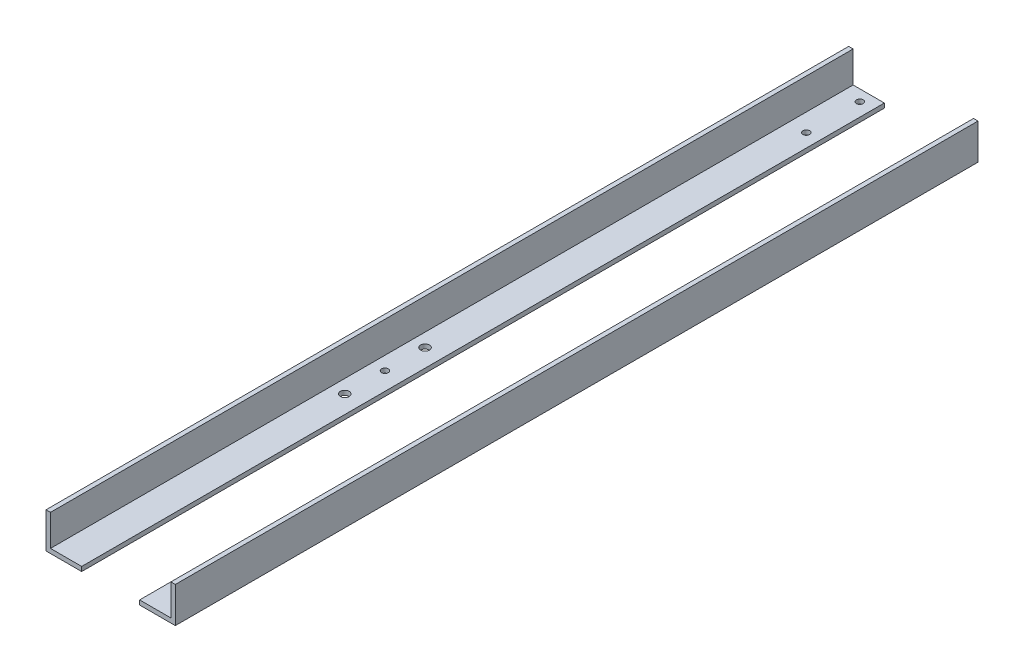
ISO-10303-21;
HEADER;
FILE_DESCRIPTION(('STEP AP214'),'2;1');
FILE_NAME('part.step','',(''),(''),'','','');
FILE_SCHEMA(('AUTOMOTIVE_DESIGN { 1 0 10303 214 1 1 1 1 }'));
ENDSEC;
DATA;
#1=APPLICATION_CONTEXT('core data for automotive mechanical design processes');
#2=APPLICATION_PROTOCOL_DEFINITION('international standard','automotive_design',2000,#1);
#3=PRODUCT_CONTEXT('',#1,'mechanical');
#4=PRODUCT('Part','Part','',(#3));
#5=PRODUCT_RELATED_PRODUCT_CATEGORY('part','',(#4));
#6=PRODUCT_DEFINITION_FORMATION('','',#4);
#7=PRODUCT_DEFINITION_CONTEXT('part definition',#1,'design');
#8=PRODUCT_DEFINITION('design','',#6,#7);
#9=PRODUCT_DEFINITION_SHAPE('','',#8);
#10=(LENGTH_UNIT() NAMED_UNIT(*) SI_UNIT(.MILLI.,.METRE.));
#11=(NAMED_UNIT(*) PLANE_ANGLE_UNIT() SI_UNIT($,.RADIAN.));
#12=(NAMED_UNIT(*) SI_UNIT($,.STERADIAN.) SOLID_ANGLE_UNIT());
#13=UNCERTAINTY_MEASURE_WITH_UNIT(LENGTH_MEASURE(1.E-05),#10,'distance_accuracy_value','');
#14=(GEOMETRIC_REPRESENTATION_CONTEXT(3) GLOBAL_UNCERTAINTY_ASSIGNED_CONTEXT((#13)) GLOBAL_UNIT_ASSIGNED_CONTEXT((#10,
#11,#12)) REPRESENTATION_CONTEXT('',''));
#15=CARTESIAN_POINT('',(0.,0.,0.));
#16=DIRECTION('',(0.,0.,1.));
#17=DIRECTION('',(1.,0.,0.));
#18=AXIS2_PLACEMENT_3D('',#15,#16,#17);
#19=CARTESIAN_POINT('',(-92.075,50.8,-571.5));
#20=DIRECTION('',(0.,0.,1.));
#21=DIRECTION('',(1.,0.,0.));
#22=AXIS2_PLACEMENT_3D('',#19,#20,#21);
#23=PLANE('',#22);
#24=DIRECTION('',(1.,0.,0.));
#25=VECTOR('',#24,1.);
#26=CARTESIAN_POINT('',(41.275,6.35,-571.5));
#27=LINE('',#26,#25);
#28=CARTESIAN_POINT('',(41.275,6.35,-571.5));
#29=VERTEX_POINT('',#28);
#30=CARTESIAN_POINT('',(85.725,6.35,-571.5));
#31=VERTEX_POINT('',#30);
#32=EDGE_CURVE('E139',#29,#31,#27,.T.);
#33=ORIENTED_EDGE('',*,*,#32,.T.);
#34=DIRECTION('',(0.,1.,0.));
#35=VECTOR('',#34,1.);
#36=CARTESIAN_POINT('',(85.725,50.8,-571.5));
#37=LINE('',#36,#35);
#38=CARTESIAN_POINT('',(85.725,50.8,-571.5));
#39=VERTEX_POINT('',#38);
#40=EDGE_CURVE('E135',#31,#39,#37,.T.);
#41=ORIENTED_EDGE('',*,*,#40,.T.);
#42=DIRECTION('',(-1.,0.,0.));
#43=VECTOR('',#42,1.);
#44=CARTESIAN_POINT('',(-92.075,50.8,-571.5));
#45=LINE('',#44,#43);
#46=CARTESIAN_POINT('',(92.075,50.8,-571.5));
#47=VERTEX_POINT('',#46);
#48=EDGE_CURVE('E114',#47,#39,#45,.T.);
#49=ORIENTED_EDGE('',*,*,#48,.F.);
#50=DIRECTION('',(0.,-1.,0.));
#51=VECTOR('',#50,1.);
#52=CARTESIAN_POINT('',(92.075,50.8,-571.5));
#53=LINE('',#52,#51);
#54=CARTESIAN_POINT('',(92.075,0.,-571.5));
#55=VERTEX_POINT('',#54);
#56=EDGE_CURVE('E138',#47,#55,#53,.T.);
#57=ORIENTED_EDGE('',*,*,#56,.T.);
#58=DIRECTION('',(-1.,0.,0.));
#59=VECTOR('',#58,1.);
#60=CARTESIAN_POINT('',(-92.075,0.,-571.5));
#61=LINE('',#60,#59);
#62=CARTESIAN_POINT('',(41.275,0.,-571.5));
#63=VERTEX_POINT('',#62);
#64=EDGE_CURVE('E46',#55,#63,#61,.T.);
#65=ORIENTED_EDGE('',*,*,#64,.T.);
#66=DIRECTION('',(0.,1.,0.));
#67=VECTOR('',#66,1.);
#68=CARTESIAN_POINT('',(41.275,6.35,-571.5));
#69=LINE('',#68,#67);
#70=EDGE_CURVE('E107',#63,#29,#69,.T.);
#71=ORIENTED_EDGE('',*,*,#70,.T.);
#72=EDGE_LOOP('',(#33,#41,#49,#57,#65,#71));
#73=FACE_BOUND('',#72,.T.);
#74=ADVANCED_FACE('F43',(#73),#23,.F.);
#75=CARTESIAN_POINT('',(-92.075,50.8,571.5));
#76=DIRECTION('',(0.,0.,-1.));
#77=DIRECTION('',(-1.,0.,0.));
#78=AXIS2_PLACEMENT_3D('',#75,#76,#77);
#79=PLANE('',#78);
#80=DIRECTION('',(1.,0.,0.));
#81=VECTOR('',#80,1.);
#82=CARTESIAN_POINT('',(-92.075,50.8,571.5));
#83=LINE('',#82,#81);
#84=CARTESIAN_POINT('',(85.725,50.8,571.5));
#85=VERTEX_POINT('',#84);
#86=CARTESIAN_POINT('',(92.075,50.8,571.5));
#87=VERTEX_POINT('',#86);
#88=EDGE_CURVE('E123',#85,#87,#83,.T.);
#89=ORIENTED_EDGE('',*,*,#88,.F.);
#90=DIRECTION('',(0.,1.,0.));
#91=VECTOR('',#90,1.);
#92=CARTESIAN_POINT('',(85.725,50.8,571.5));
#93=LINE('',#92,#91);
#94=CARTESIAN_POINT('',(85.725,6.35,571.5));
#95=VERTEX_POINT('',#94);
#96=EDGE_CURVE('E122',#95,#85,#93,.T.);
#97=ORIENTED_EDGE('',*,*,#96,.F.);
#98=DIRECTION('',(1.,0.,0.));
#99=VECTOR('',#98,1.);
#100=CARTESIAN_POINT('',(41.275,6.35,571.5));
#101=LINE('',#100,#99);
#102=CARTESIAN_POINT('',(41.275,6.35,571.5));
#103=VERTEX_POINT('',#102);
#104=EDGE_CURVE('E127',#103,#95,#101,.T.);
#105=ORIENTED_EDGE('',*,*,#104,.F.);
#106=DIRECTION('',(0.,1.,0.));
#107=VECTOR('',#106,1.);
#108=CARTESIAN_POINT('',(41.275,6.35,571.5));
#109=LINE('',#108,#107);
#110=CARTESIAN_POINT('',(41.275,0.,571.5));
#111=VERTEX_POINT('',#110);
#112=EDGE_CURVE('E52',#111,#103,#109,.T.);
#113=ORIENTED_EDGE('',*,*,#112,.F.);
#114=DIRECTION('',(1.,0.,0.));
#115=VECTOR('',#114,1.);
#116=CARTESIAN_POINT('',(-92.075,0.,571.5));
#117=LINE('',#116,#115);
#118=CARTESIAN_POINT('',(92.075,0.,571.5));
#119=VERTEX_POINT('',#118);
#120=EDGE_CURVE('E97',#111,#119,#117,.T.);
#121=ORIENTED_EDGE('',*,*,#120,.T.);
#122=DIRECTION('',(0.,-1.,0.));
#123=VECTOR('',#122,1.);
#124=CARTESIAN_POINT('',(92.075,50.8,571.5));
#125=LINE('',#124,#123);
#126=EDGE_CURVE('E101',#87,#119,#125,.T.);
#127=ORIENTED_EDGE('',*,*,#126,.F.);
#128=EDGE_LOOP('',(#89,#97,#105,#113,#121,#127));
#129=FACE_BOUND('',#128,.T.);
#130=ADVANCED_FACE('F100',(#129),#79,.F.);
#131=CARTESIAN_POINT('',(0.,0.,0.));
#132=DIRECTION('',(0.,-1.,0.));
#133=DIRECTION('',(0.,0.,-1.));
#134=AXIS2_PLACEMENT_3D('',#131,#132,#133);
#135=PLANE('',#134);
#136=CARTESIAN_POINT('',(60.325,0.,-555.625));
#137=DIRECTION('',(0.,1.,0.));
#138=DIRECTION('',(0.,0.,1.));
#139=AXIS2_PLACEMENT_3D('',#136,#137,#138);
#140=CIRCLE('',#139,4.76250000000001);
#141=CARTESIAN_POINT('',(60.325,0.,-550.8625));
#142=VERTEX_POINT('',#141);
#143=EDGE_CURVE('E142',#142,#142,#140,.T.);
#144=ORIENTED_EDGE('',*,*,#143,.T.);
#145=EDGE_LOOP('',(#144));
#146=FACE_BOUND('',#145,.T.);
#147=CARTESIAN_POINT('',(60.325,0.,-479.425));
#148=DIRECTION('',(0.,1.,0.));
#149=DIRECTION('',(0.,0.,1.));
#150=AXIS2_PLACEMENT_3D('',#147,#148,#149);
#151=CIRCLE('',#150,4.7625);
#152=CARTESIAN_POINT('',(60.325,0.,-474.6625));
#153=VERTEX_POINT('',#152);
#154=EDGE_CURVE('E272',#153,#153,#151,.T.);
#155=ORIENTED_EDGE('',*,*,#154,.T.);
#156=EDGE_LOOP('',(#155));
#157=FACE_BOUND('',#156,.T.);
#158=CARTESIAN_POINT('',(60.325,0.,114.3));
#159=DIRECTION('',(0.,1.,0.));
#160=DIRECTION('',(0.,0.,1.));
#161=AXIS2_PLACEMENT_3D('',#158,#159,#160);
#162=CIRCLE('',#161,4.7625);
#163=CARTESIAN_POINT('',(60.325,0.,119.0625));
#164=VERTEX_POINT('',#163);
#165=EDGE_CURVE('E281',#164,#164,#162,.T.);
#166=ORIENTED_EDGE('',*,*,#165,.T.);
#167=EDGE_LOOP('',(#166));
#168=FACE_BOUND('',#167,.T.);
#169=CARTESIAN_POINT('',(60.325,0.,57.15));
#170=DIRECTION('',(0.,1.,0.));
#171=DIRECTION('',(0.,0.,1.));
#172=AXIS2_PLACEMENT_3D('',#169,#170,#171);
#173=CIRCLE('',#172,6.35);
#174=CARTESIAN_POINT('',(60.325,0.,63.5));
#175=VERTEX_POINT('',#174);
#176=EDGE_CURVE('E287',#175,#175,#173,.T.);
#177=ORIENTED_EDGE('',*,*,#176,.T.);
#178=EDGE_LOOP('',(#177));
#179=FACE_BOUND('',#178,.T.);
#180=CARTESIAN_POINT('',(60.325,0.,171.45));
#181=DIRECTION('',(0.,1.,0.));
#182=DIRECTION('',(0.,0.,1.));
#183=AXIS2_PLACEMENT_3D('',#180,#181,#182);
#184=CIRCLE('',#183,6.34999999999999);
#185=CARTESIAN_POINT('',(60.325,0.,177.8));
#186=VERTEX_POINT('',#185);
#187=EDGE_CURVE('E293',#186,#186,#184,.T.);
#188=ORIENTED_EDGE('',*,*,#187,.T.);
#189=EDGE_LOOP('',(#188));
#190=FACE_BOUND('',#189,.T.);
#191=DIRECTION('',(0.,0.,1.));
#192=VECTOR('',#191,1.);
#193=CARTESIAN_POINT('',(41.275,0.,-571.5));
#194=LINE('',#193,#192);
#195=EDGE_CURVE('E12',#63,#111,#194,.T.);
#196=ORIENTED_EDGE('',*,*,#195,.F.);
#197=ORIENTED_EDGE('',*,*,#64,.F.);
#198=DIRECTION('',(0.,0.,-1.));
#199=VECTOR('',#198,1.);
#200=CARTESIAN_POINT('',(92.075,0.,571.5));
#201=LINE('',#200,#199);
#202=EDGE_CURVE('E106',#119,#55,#201,.T.);
#203=ORIENTED_EDGE('',*,*,#202,.F.);
#204=ORIENTED_EDGE('',*,*,#120,.F.);
#205=EDGE_LOOP('',(#196,#197,#203,#204));
#206=FACE_BOUND('',#205,.T.);
#207=ADVANCED_FACE('F116',(#146,#157,#168,#179,#190,#206),#135,.T.);
#208=CARTESIAN_POINT('',(92.075,50.8,571.5));
#209=DIRECTION('',(-1.,0.,0.));
#210=DIRECTION('',(0.,0.,1.));
#211=AXIS2_PLACEMENT_3D('',#208,#209,#210);
#212=PLANE('',#211);
#213=ORIENTED_EDGE('',*,*,#202,.T.);
#214=ORIENTED_EDGE('',*,*,#56,.F.);
#215=DIRECTION('',(0.,0.,-1.));
#216=VECTOR('',#215,1.);
#217=CARTESIAN_POINT('',(92.075,50.8,571.5));
#218=LINE('',#217,#216);
#219=EDGE_CURVE('E113',#87,#47,#218,.T.);
#220=ORIENTED_EDGE('',*,*,#219,.F.);
#221=ORIENTED_EDGE('',*,*,#126,.T.);
#222=EDGE_LOOP('',(#213,#214,#220,#221));
#223=FACE_BOUND('',#222,.T.);
#224=ADVANCED_FACE('F110',(#223),#212,.F.);
#225=CARTESIAN_POINT('',(0.,50.8,0.));
#226=DIRECTION('',(0.,-1.,0.));
#227=DIRECTION('',(0.,0.,-1.));
#228=AXIS2_PLACEMENT_3D('',#225,#226,#227);
#229=PLANE('',#228);
#230=ORIENTED_EDGE('',*,*,#48,.T.);
#231=DIRECTION('',(0.,0.,1.));
#232=VECTOR('',#231,1.);
#233=CARTESIAN_POINT('',(85.725,50.8,-571.5));
#234=LINE('',#233,#232);
#235=EDGE_CURVE('E129',#39,#85,#234,.T.);
#236=ORIENTED_EDGE('',*,*,#235,.T.);
#237=ORIENTED_EDGE('',*,*,#88,.T.);
#238=ORIENTED_EDGE('',*,*,#219,.T.);
#239=EDGE_LOOP('',(#230,#236,#237,#238));
#240=FACE_BOUND('',#239,.T.);
#241=ADVANCED_FACE('F148',(#240),#229,.F.);
#242=CARTESIAN_POINT('',(85.725,50.8,-571.5));
#243=DIRECTION('',(1.,0.,0.));
#244=DIRECTION('',(0.,1.,0.));
#245=AXIS2_PLACEMENT_3D('',#242,#243,#244);
#246=PLANE('',#245);
#247=ORIENTED_EDGE('',*,*,#96,.T.);
#248=ORIENTED_EDGE('',*,*,#235,.F.);
#249=ORIENTED_EDGE('',*,*,#40,.F.);
#250=DIRECTION('',(0.,0.,1.));
#251=VECTOR('',#250,1.);
#252=CARTESIAN_POINT('',(85.725,6.35,-571.5));
#253=LINE('',#252,#251);
#254=EDGE_CURVE('E76',#31,#95,#253,.T.);
#255=ORIENTED_EDGE('',*,*,#254,.T.);
#256=EDGE_LOOP('',(#247,#248,#249,#255));
#257=FACE_BOUND('',#256,.T.);
#258=ADVANCED_FACE('F150',(#257),#246,.F.);
#259=CARTESIAN_POINT('',(41.275,6.35,-571.5));
#260=DIRECTION('',(0.,-1.,0.));
#261=DIRECTION('',(0.,0.,-1.));
#262=AXIS2_PLACEMENT_3D('',#259,#260,#261);
#263=PLANE('',#262);
#264=CARTESIAN_POINT('',(60.325,6.35,-555.625));
#265=DIRECTION('',(0.,1.,0.));
#266=DIRECTION('',(0.,0.,1.));
#267=AXIS2_PLACEMENT_3D('',#264,#265,#266);
#268=CIRCLE('',#267,4.76250000000001);
#269=CARTESIAN_POINT('',(60.325,6.35,-550.8625));
#270=VERTEX_POINT('',#269);
#271=EDGE_CURVE('E271',#270,#270,#268,.T.);
#272=ORIENTED_EDGE('',*,*,#271,.F.);
#273=EDGE_LOOP('',(#272));
#274=FACE_BOUND('',#273,.T.);
#275=CARTESIAN_POINT('',(60.325,6.35,-479.425));
#276=DIRECTION('',(0.,1.,0.));
#277=DIRECTION('',(0.,0.,1.));
#278=AXIS2_PLACEMENT_3D('',#275,#276,#277);
#279=CIRCLE('',#278,4.7625);
#280=CARTESIAN_POINT('',(60.325,6.35,-474.6625));
#281=VERTEX_POINT('',#280);
#282=EDGE_CURVE('E276',#281,#281,#279,.T.);
#283=ORIENTED_EDGE('',*,*,#282,.F.);
#284=EDGE_LOOP('',(#283));
#285=FACE_BOUND('',#284,.T.);
#286=CARTESIAN_POINT('',(60.325,6.35,114.3));
#287=DIRECTION('',(0.,1.,0.));
#288=DIRECTION('',(0.,0.,1.));
#289=AXIS2_PLACEMENT_3D('',#286,#287,#288);
#290=CIRCLE('',#289,4.7625);
#291=CARTESIAN_POINT('',(60.325,6.35,119.0625));
#292=VERTEX_POINT('',#291);
#293=EDGE_CURVE('E284',#292,#292,#290,.T.);
#294=ORIENTED_EDGE('',*,*,#293,.F.);
#295=EDGE_LOOP('',(#294));
#296=FACE_BOUND('',#295,.T.);
#297=CARTESIAN_POINT('',(60.325,6.35,57.15));
#298=DIRECTION('',(0.,1.,0.));
#299=DIRECTION('',(0.,0.,1.));
#300=AXIS2_PLACEMENT_3D('',#297,#298,#299);
#301=CIRCLE('',#300,6.35);
#302=CARTESIAN_POINT('',(60.325,6.35,63.5));
#303=VERTEX_POINT('',#302);
#304=EDGE_CURVE('E290',#303,#303,#301,.T.);
#305=ORIENTED_EDGE('',*,*,#304,.F.);
#306=EDGE_LOOP('',(#305));
#307=FACE_BOUND('',#306,.T.);
#308=CARTESIAN_POINT('',(60.325,6.35,171.45));
#309=DIRECTION('',(0.,1.,0.));
#310=DIRECTION('',(0.,0.,1.));
#311=AXIS2_PLACEMENT_3D('',#308,#309,#310);
#312=CIRCLE('',#311,6.34999999999999);
#313=CARTESIAN_POINT('',(60.325,6.35,177.8));
#314=VERTEX_POINT('',#313);
#315=EDGE_CURVE('E296',#314,#314,#312,.T.);
#316=ORIENTED_EDGE('',*,*,#315,.F.);
#317=EDGE_LOOP('',(#316));
#318=FACE_BOUND('',#317,.T.);
#319=ORIENTED_EDGE('',*,*,#104,.T.);
#320=ORIENTED_EDGE('',*,*,#254,.F.);
#321=ORIENTED_EDGE('',*,*,#32,.F.);
#322=DIRECTION('',(0.,0.,1.));
#323=VECTOR('',#322,1.);
#324=CARTESIAN_POINT('',(41.275,6.35,-571.5));
#325=LINE('',#324,#323);
#326=EDGE_CURVE('E125',#29,#103,#325,.T.);
#327=ORIENTED_EDGE('',*,*,#326,.T.);
#328=EDGE_LOOP('',(#319,#320,#321,#327));
#329=FACE_BOUND('',#328,.T.);
#330=ADVANCED_FACE('F152',(#274,#285,#296,#307,#318,#329),#263,.F.);
#331=CARTESIAN_POINT('',(41.275,6.35,-571.5));
#332=DIRECTION('',(1.,0.,0.));
#333=DIRECTION('',(0.,0.,-1.));
#334=AXIS2_PLACEMENT_3D('',#331,#332,#333);
#335=PLANE('',#334);
#336=ORIENTED_EDGE('',*,*,#112,.T.);
#337=ORIENTED_EDGE('',*,*,#326,.F.);
#338=ORIENTED_EDGE('',*,*,#70,.F.);
#339=ORIENTED_EDGE('',*,*,#195,.T.);
#340=EDGE_LOOP('',(#336,#337,#338,#339));
#341=FACE_BOUND('',#340,.T.);
#342=ADVANCED_FACE('F154',(#341),#335,.F.);
#343=CARTESIAN_POINT('',(60.325,0.,171.45));
#344=DIRECTION('',(0.,1.,0.));
#345=DIRECTION('',(0.,0.,1.));
#346=AXIS2_PLACEMENT_3D('',#343,#344,#345);
#347=CYLINDRICAL_SURFACE('',#346,6.34999999999999);
#348=ORIENTED_EDGE('',*,*,#187,.F.);
#349=EDGE_LOOP('',(#348));
#350=FACE_BOUND('',#349,.T.);
#351=ORIENTED_EDGE('',*,*,#315,.T.);
#352=EDGE_LOOP('',(#351));
#353=FACE_BOUND('',#352,.T.);
#354=ADVANCED_FACE('F156',(#350,#353),#347,.F.);
#355=CARTESIAN_POINT('',(60.325,0.,57.15));
#356=DIRECTION('',(0.,1.,0.));
#357=DIRECTION('',(0.,0.,1.));
#358=AXIS2_PLACEMENT_3D('',#355,#356,#357);
#359=CYLINDRICAL_SURFACE('',#358,6.35);
#360=ORIENTED_EDGE('',*,*,#176,.F.);
#361=EDGE_LOOP('',(#360));
#362=FACE_BOUND('',#361,.T.);
#363=ORIENTED_EDGE('',*,*,#304,.T.);
#364=EDGE_LOOP('',(#363));
#365=FACE_BOUND('',#364,.T.);
#366=ADVANCED_FACE('F162',(#362,#365),#359,.F.);
#367=CARTESIAN_POINT('',(60.325,0.,114.3));
#368=DIRECTION('',(0.,1.,0.));
#369=DIRECTION('',(0.,0.,1.));
#370=AXIS2_PLACEMENT_3D('',#367,#368,#369);
#371=CYLINDRICAL_SURFACE('',#370,4.7625);
#372=ORIENTED_EDGE('',*,*,#165,.F.);
#373=EDGE_LOOP('',(#372));
#374=FACE_BOUND('',#373,.T.);
#375=ORIENTED_EDGE('',*,*,#293,.T.);
#376=EDGE_LOOP('',(#375));
#377=FACE_BOUND('',#376,.T.);
#378=ADVANCED_FACE('F209',(#374,#377),#371,.F.);
#379=CARTESIAN_POINT('',(60.325,0.,-479.425));
#380=DIRECTION('',(0.,1.,0.));
#381=DIRECTION('',(0.,0.,1.));
#382=AXIS2_PLACEMENT_3D('',#379,#380,#381);
#383=CYLINDRICAL_SURFACE('',#382,4.7625);
#384=ORIENTED_EDGE('',*,*,#154,.F.);
#385=EDGE_LOOP('',(#384));
#386=FACE_BOUND('',#385,.T.);
#387=ORIENTED_EDGE('',*,*,#282,.T.);
#388=EDGE_LOOP('',(#387));
#389=FACE_BOUND('',#388,.T.);
#390=ADVANCED_FACE('F219',(#386,#389),#383,.F.);
#391=CARTESIAN_POINT('',(60.325,0.,-555.625));
#392=DIRECTION('',(0.,1.,0.));
#393=DIRECTION('',(0.,0.,1.));
#394=AXIS2_PLACEMENT_3D('',#391,#392,#393);
#395=CYLINDRICAL_SURFACE('',#394,4.76250000000001);
#396=ORIENTED_EDGE('',*,*,#143,.F.);
#397=EDGE_LOOP('',(#396));
#398=FACE_BOUND('',#397,.T.);
#399=ORIENTED_EDGE('',*,*,#271,.T.);
#400=EDGE_LOOP('',(#399));
#401=FACE_BOUND('',#400,.T.);
#402=ADVANCED_FACE('F229',(#398,#401),#395,.F.);
#403=CLOSED_SHELL('',(#74,#130,#207,#224,#241,#258,#330,#342,#354,#366,#378,#390,#402));
#404=MANIFOLD_SOLID_BREP('B2',#403);
#405=CARTESIAN_POINT('',(-92.075,50.8,571.5));
#406=DIRECTION('',(1.,0.,0.));
#407=DIRECTION('',(0.,0.,-1.));
#408=AXIS2_PLACEMENT_3D('',#405,#406,#407);
#409=PLANE('',#408);
#410=DIRECTION('',(0.,0.,1.));
#411=VECTOR('',#410,1.);
#412=CARTESIAN_POINT('',(-92.075,0.,571.5));
#413=LINE('',#412,#411);
#414=CARTESIAN_POINT('',(-92.075,0.,-571.5));
#415=VERTEX_POINT('',#414);
#416=CARTESIAN_POINT('',(-92.075,0.,571.5));
#417=VERTEX_POINT('',#416);
#418=EDGE_CURVE('E360',#415,#417,#413,.T.);
#419=ORIENTED_EDGE('',*,*,#418,.T.);
#420=DIRECTION('',(0.,-1.,0.));
#421=VECTOR('',#420,1.);
#422=CARTESIAN_POINT('',(-92.075,50.8,571.5));
#423=LINE('',#422,#421);
#424=CARTESIAN_POINT('',(-92.075,50.8,571.5));
#425=VERTEX_POINT('',#424);
#426=EDGE_CURVE('E332',#425,#417,#423,.T.);
#427=ORIENTED_EDGE('',*,*,#426,.F.);
#428=DIRECTION('',(0.,0.,1.));
#429=VECTOR('',#428,1.);
#430=CARTESIAN_POINT('',(-92.075,50.8,571.5));
#431=LINE('',#430,#429);
#432=CARTESIAN_POINT('',(-92.075,50.8,-571.5));
#433=VERTEX_POINT('',#432);
#434=EDGE_CURVE('E348',#433,#425,#431,.T.);
#435=ORIENTED_EDGE('',*,*,#434,.F.);
#436=DIRECTION('',(0.,-1.,0.));
#437=VECTOR('',#436,1.);
#438=CARTESIAN_POINT('',(-92.075,50.8,-571.5));
#439=LINE('',#438,#437);
#440=EDGE_CURVE('E41',#433,#415,#439,.T.);
#441=ORIENTED_EDGE('',*,*,#440,.T.);
#442=EDGE_LOOP('',(#419,#427,#435,#441));
#443=FACE_BOUND('',#442,.T.);
#444=ADVANCED_FACE('F324',(#443),#409,.F.);
#445=CARTESIAN_POINT('',(0.,0.,0.));
#446=DIRECTION('',(0.,-1.,0.));
#447=DIRECTION('',(0.,0.,-1.));
#448=AXIS2_PLACEMENT_3D('',#445,#446,#447);
#449=PLANE('',#448);
#450=CARTESIAN_POINT('',(-60.325,0.,-555.625));
#451=DIRECTION('',(0.,1.,0.));
#452=DIRECTION('',(0.,0.,1.));
#453=AXIS2_PLACEMENT_3D('',#450,#451,#452);
#454=CIRCLE('',#453,4.76250000000002);
#455=CARTESIAN_POINT('',(-60.325,0.,-550.8625));
#456=VERTEX_POINT('',#455);
#457=EDGE_CURVE('E403',#456,#456,#454,.T.);
#458=ORIENTED_EDGE('',*,*,#457,.T.);
#459=EDGE_LOOP('',(#458));
#460=FACE_BOUND('',#459,.T.);
#461=CARTESIAN_POINT('',(-60.325,0.,-479.425));
#462=DIRECTION('',(0.,1.,0.));
#463=DIRECTION('',(0.,0.,1.));
#464=AXIS2_PLACEMENT_3D('',#461,#462,#463);
#465=CIRCLE('',#464,4.7625);
#466=CARTESIAN_POINT('',(-60.325,0.,-474.6625));
#467=VERTEX_POINT('',#466);
#468=EDGE_CURVE('E432',#467,#467,#465,.T.);
#469=ORIENTED_EDGE('',*,*,#468,.T.);
#470=EDGE_LOOP('',(#469));
#471=FACE_BOUND('',#470,.T.);
#472=CARTESIAN_POINT('',(-66.675,0.,114.3));
#473=DIRECTION('',(0.,1.,0.));
#474=DIRECTION('',(0.,0.,1.));
#475=AXIS2_PLACEMENT_3D('',#472,#473,#474);
#476=CIRCLE('',#475,4.7625);
#477=CARTESIAN_POINT('',(-66.675,0.,119.0625));
#478=VERTEX_POINT('',#477);
#479=EDGE_CURVE('E426',#478,#478,#476,.T.);
#480=ORIENTED_EDGE('',*,*,#479,.T.);
#481=EDGE_LOOP('',(#480));
#482=FACE_BOUND('',#481,.T.);
#483=CARTESIAN_POINT('',(-66.675,0.,57.15));
#484=DIRECTION('',(0.,1.,0.));
#485=DIRECTION('',(0.,0.,1.));
#486=AXIS2_PLACEMENT_3D('',#483,#484,#485);
#487=CIRCLE('',#486,6.35);
#488=CARTESIAN_POINT('',(-66.675,0.,63.5));
#489=VERTEX_POINT('',#488);
#490=EDGE_CURVE('E420',#489,#489,#487,.T.);
#491=ORIENTED_EDGE('',*,*,#490,.T.);
#492=EDGE_LOOP('',(#491));
#493=FACE_BOUND('',#492,.T.);
#494=CARTESIAN_POINT('',(-66.675,0.,171.45));
#495=DIRECTION('',(0.,1.,0.));
#496=DIRECTION('',(0.,0.,1.));
#497=AXIS2_PLACEMENT_3D('',#494,#495,#496);
#498=CIRCLE('',#497,6.35);
#499=CARTESIAN_POINT('',(-66.675,0.,177.8));
#500=VERTEX_POINT('',#499);
#501=EDGE_CURVE('E414',#500,#500,#498,.T.);
#502=ORIENTED_EDGE('',*,*,#501,.T.);
#503=EDGE_LOOP('',(#502));
#504=FACE_BOUND('',#503,.T.);
#505=DIRECTION('',(0.,0.,1.));
#506=VECTOR('',#505,1.);
#507=CARTESIAN_POINT('',(-41.275,0.,-571.5));
#508=LINE('',#507,#506);
#509=CARTESIAN_POINT('',(-41.275,0.,-571.5));
#510=VERTEX_POINT('',#509);
#511=CARTESIAN_POINT('',(-41.275,0.,571.5));
#512=VERTEX_POINT('',#511);
#513=EDGE_CURVE('E377',#510,#512,#508,.T.);
#514=ORIENTED_EDGE('',*,*,#513,.T.);
#515=DIRECTION('',(1.,0.,0.));
#516=VECTOR('',#515,1.);
#517=CARTESIAN_POINT('',(-92.075,0.,571.5));
#518=LINE('',#517,#516);
#519=EDGE_CURVE('E367',#417,#512,#518,.T.);
#520=ORIENTED_EDGE('',*,*,#519,.F.);
#521=ORIENTED_EDGE('',*,*,#418,.F.);
#522=DIRECTION('',(-1.,0.,0.));
#523=VECTOR('',#522,1.);
#524=CARTESIAN_POINT('',(-92.075,0.,-571.5));
#525=LINE('',#524,#523);
#526=EDGE_CURVE('E368',#510,#415,#525,.T.);
#527=ORIENTED_EDGE('',*,*,#526,.F.);
#528=EDGE_LOOP('',(#514,#520,#521,#527));
#529=FACE_BOUND('',#528,.T.);
#530=ADVANCED_FACE('F376',(#460,#471,#482,#493,#504,#529),#449,.T.);
#531=CARTESIAN_POINT('',(0.,50.8,0.));
#532=DIRECTION('',(0.,-1.,0.));
#533=DIRECTION('',(0.,0.,-1.));
#534=AXIS2_PLACEMENT_3D('',#531,#532,#533);
#535=PLANE('',#534);
#536=DIRECTION('',(1.,0.,0.));
#537=VECTOR('',#536,1.);
#538=CARTESIAN_POINT('',(-92.075,50.8,571.5));
#539=LINE('',#538,#537);
#540=CARTESIAN_POINT('',(-85.725,50.8,571.5));
#541=VERTEX_POINT('',#540);
#542=EDGE_CURVE('E375',#425,#541,#539,.T.);
#543=ORIENTED_EDGE('',*,*,#542,.T.);
#544=DIRECTION('',(0.,0.,1.));
#545=VECTOR('',#544,1.);
#546=CARTESIAN_POINT('',(-85.725,50.8,-571.5));
#547=LINE('',#546,#545);
#548=CARTESIAN_POINT('',(-85.725,50.8,-571.5));
#549=VERTEX_POINT('',#548);
#550=EDGE_CURVE('E383',#549,#541,#547,.T.);
#551=ORIENTED_EDGE('',*,*,#550,.F.);
#552=DIRECTION('',(-1.,0.,0.));
#553=VECTOR('',#552,1.);
#554=CARTESIAN_POINT('',(-92.075,50.8,-571.5));
#555=LINE('',#554,#553);
#556=EDGE_CURVE('E378',#549,#433,#555,.T.);
#557=ORIENTED_EDGE('',*,*,#556,.T.);
#558=ORIENTED_EDGE('',*,*,#434,.T.);
#559=EDGE_LOOP('',(#543,#551,#557,#558));
#560=FACE_BOUND('',#559,.T.);
#561=ADVANCED_FACE('F485',(#560),#535,.F.);
#562=CARTESIAN_POINT('',(-92.075,50.8,571.5));
#563=DIRECTION('',(0.,0.,-1.));
#564=DIRECTION('',(-1.,0.,0.));
#565=AXIS2_PLACEMENT_3D('',#562,#563,#564);
#566=PLANE('',#565);
#567=DIRECTION('',(1.,0.,0.));
#568=VECTOR('',#567,1.);
#569=CARTESIAN_POINT('',(-85.725,6.35,571.5));
#570=LINE('',#569,#568);
#571=CARTESIAN_POINT('',(-85.725,6.35,571.5));
#572=VERTEX_POINT('',#571);
#573=CARTESIAN_POINT('',(-41.275,6.35,571.5));
#574=VERTEX_POINT('',#573);
#575=EDGE_CURVE('E397',#572,#574,#570,.T.);
#576=ORIENTED_EDGE('',*,*,#575,.F.);
#577=DIRECTION('',(0.,-1.,0.));
#578=VECTOR('',#577,1.);
#579=CARTESIAN_POINT('',(-85.725,50.8,571.5));
#580=LINE('',#579,#578);
#581=EDGE_CURVE('E400',#541,#572,#580,.T.);
#582=ORIENTED_EDGE('',*,*,#581,.F.);
#583=ORIENTED_EDGE('',*,*,#542,.F.);
#584=ORIENTED_EDGE('',*,*,#426,.T.);
#585=ORIENTED_EDGE('',*,*,#519,.T.);
#586=DIRECTION('',(0.,-1.,0.));
#587=VECTOR('',#586,1.);
#588=CARTESIAN_POINT('',(-41.275,6.35,571.5));
#589=LINE('',#588,#587);
#590=EDGE_CURVE('E339',#574,#512,#589,.T.);
#591=ORIENTED_EDGE('',*,*,#590,.F.);
#592=EDGE_LOOP('',(#576,#582,#583,#584,#585,#591));
#593=FACE_BOUND('',#592,.T.);
#594=ADVANCED_FACE('F373',(#593),#566,.F.);
#595=CARTESIAN_POINT('',(-92.075,50.8,-571.5));
#596=DIRECTION('',(0.,0.,1.));
#597=DIRECTION('',(1.,0.,0.));
#598=AXIS2_PLACEMENT_3D('',#595,#596,#597);
#599=PLANE('',#598);
#600=ORIENTED_EDGE('',*,*,#556,.F.);
#601=DIRECTION('',(0.,-1.,0.));
#602=VECTOR('',#601,1.);
#603=CARTESIAN_POINT('',(-85.725,50.8,-571.5));
#604=LINE('',#603,#602);
#605=CARTESIAN_POINT('',(-85.725,6.35,-571.5));
#606=VERTEX_POINT('',#605);
#607=EDGE_CURVE('E396',#549,#606,#604,.T.);
#608=ORIENTED_EDGE('',*,*,#607,.T.);
#609=DIRECTION('',(1.,0.,0.));
#610=VECTOR('',#609,1.);
#611=CARTESIAN_POINT('',(-85.725,6.35,-571.5));
#612=LINE('',#611,#610);
#613=CARTESIAN_POINT('',(-41.275,6.35,-571.5));
#614=VERTEX_POINT('',#613);
#615=EDGE_CURVE('E406',#606,#614,#612,.T.);
#616=ORIENTED_EDGE('',*,*,#615,.T.);
#617=DIRECTION('',(0.,-1.,0.));
#618=VECTOR('',#617,1.);
#619=CARTESIAN_POINT('',(-41.275,6.35,-571.5));
#620=LINE('',#619,#618);
#621=EDGE_CURVE('E390',#614,#510,#620,.T.);
#622=ORIENTED_EDGE('',*,*,#621,.T.);
#623=ORIENTED_EDGE('',*,*,#526,.T.);
#624=ORIENTED_EDGE('',*,*,#440,.F.);
#625=EDGE_LOOP('',(#600,#608,#616,#622,#623,#624));
#626=FACE_BOUND('',#625,.T.);
#627=ADVANCED_FACE('F326',(#626),#599,.F.);
#628=CARTESIAN_POINT('',(-41.275,6.35,-571.5));
#629=DIRECTION('',(-1.,0.,0.));
#630=DIRECTION('',(0.,0.,1.));
#631=AXIS2_PLACEMENT_3D('',#628,#629,#630);
#632=PLANE('',#631);
#633=ORIENTED_EDGE('',*,*,#590,.T.);
#634=ORIENTED_EDGE('',*,*,#513,.F.);
#635=ORIENTED_EDGE('',*,*,#621,.F.);
#636=DIRECTION('',(0.,0.,1.));
#637=VECTOR('',#636,1.);
#638=CARTESIAN_POINT('',(-41.275,6.35,-571.5));
#639=LINE('',#638,#637);
#640=EDGE_CURVE('E389',#614,#574,#639,.T.);
#641=ORIENTED_EDGE('',*,*,#640,.T.);
#642=EDGE_LOOP('',(#633,#634,#635,#641));
#643=FACE_BOUND('',#642,.T.);
#644=ADVANCED_FACE('F486',(#643),#632,.F.);
#645=CARTESIAN_POINT('',(-85.725,50.8,-571.5));
#646=DIRECTION('',(-1.,0.,0.));
#647=DIRECTION('',(0.,0.,1.));
#648=AXIS2_PLACEMENT_3D('',#645,#646,#647);
#649=PLANE('',#648);
#650=ORIENTED_EDGE('',*,*,#581,.T.);
#651=DIRECTION('',(0.,0.,1.));
#652=VECTOR('',#651,1.);
#653=CARTESIAN_POINT('',(-85.725,6.35,-571.5));
#654=LINE('',#653,#652);
#655=EDGE_CURVE('E386',#606,#572,#654,.T.);
#656=ORIENTED_EDGE('',*,*,#655,.F.);
#657=ORIENTED_EDGE('',*,*,#607,.F.);
#658=ORIENTED_EDGE('',*,*,#550,.T.);
#659=EDGE_LOOP('',(#650,#656,#657,#658));
#660=FACE_BOUND('',#659,.T.);
#661=ADVANCED_FACE('F454',(#660),#649,.F.);
#662=CARTESIAN_POINT('',(-85.725,6.35,-571.5));
#663=DIRECTION('',(0.,-1.,0.));
#664=DIRECTION('',(0.,0.,-1.));
#665=AXIS2_PLACEMENT_3D('',#662,#663,#664);
#666=PLANE('',#665);
#667=CARTESIAN_POINT('',(-60.325,6.35,-555.625));
#668=DIRECTION('',(0.,1.,0.));
#669=DIRECTION('',(0.,0.,1.));
#670=AXIS2_PLACEMENT_3D('',#667,#668,#669);
#671=CIRCLE('',#670,4.76250000000002);
#672=CARTESIAN_POINT('',(-60.325,6.35,-550.8625));
#673=VERTEX_POINT('',#672);
#674=EDGE_CURVE('E435',#673,#673,#671,.T.);
#675=ORIENTED_EDGE('',*,*,#674,.F.);
#676=EDGE_LOOP('',(#675));
#677=FACE_BOUND('',#676,.T.);
#678=CARTESIAN_POINT('',(-60.325,6.35,-479.425));
#679=DIRECTION('',(0.,1.,0.));
#680=DIRECTION('',(0.,0.,1.));
#681=AXIS2_PLACEMENT_3D('',#678,#679,#680);
#682=CIRCLE('',#681,4.7625);
#683=CARTESIAN_POINT('',(-60.325,6.35,-474.6625));
#684=VERTEX_POINT('',#683);
#685=EDGE_CURVE('E429',#684,#684,#682,.T.);
#686=ORIENTED_EDGE('',*,*,#685,.F.);
#687=EDGE_LOOP('',(#686));
#688=FACE_BOUND('',#687,.T.);
#689=CARTESIAN_POINT('',(-66.675,6.35,114.3));
#690=DIRECTION('',(0.,1.,0.));
#691=DIRECTION('',(0.,0.,1.));
#692=AXIS2_PLACEMENT_3D('',#689,#690,#691);
#693=CIRCLE('',#692,4.7625);
#694=CARTESIAN_POINT('',(-66.675,6.35,119.0625));
#695=VERTEX_POINT('',#694);
#696=EDGE_CURVE('E423',#695,#695,#693,.T.);
#697=ORIENTED_EDGE('',*,*,#696,.F.);
#698=EDGE_LOOP('',(#697));
#699=FACE_BOUND('',#698,.T.);
#700=CARTESIAN_POINT('',(-66.675,6.35,57.15));
#701=DIRECTION('',(0.,1.,0.));
#702=DIRECTION('',(0.,0.,1.));
#703=AXIS2_PLACEMENT_3D('',#700,#701,#702);
#704=CIRCLE('',#703,6.35);
#705=CARTESIAN_POINT('',(-66.675,6.35,63.5));
#706=VERTEX_POINT('',#705);
#707=EDGE_CURVE('E417',#706,#706,#704,.T.);
#708=ORIENTED_EDGE('',*,*,#707,.F.);
#709=EDGE_LOOP('',(#708));
#710=FACE_BOUND('',#709,.T.);
#711=CARTESIAN_POINT('',(-66.675,6.35,171.45));
#712=DIRECTION('',(0.,1.,0.));
#713=DIRECTION('',(0.,0.,1.));
#714=AXIS2_PLACEMENT_3D('',#711,#712,#713);
#715=CIRCLE('',#714,6.35);
#716=CARTESIAN_POINT('',(-66.675,6.35,177.8));
#717=VERTEX_POINT('',#716);
#718=EDGE_CURVE('E411',#717,#717,#715,.T.);
#719=ORIENTED_EDGE('',*,*,#718,.F.);
#720=EDGE_LOOP('',(#719));
#721=FACE_BOUND('',#720,.T.);
#722=ORIENTED_EDGE('',*,*,#575,.T.);
#723=ORIENTED_EDGE('',*,*,#640,.F.);
#724=ORIENTED_EDGE('',*,*,#615,.F.);
#725=ORIENTED_EDGE('',*,*,#655,.T.);
#726=EDGE_LOOP('',(#722,#723,#724,#725));
#727=FACE_BOUND('',#726,.T.);
#728=ADVANCED_FACE('F450',(#677,#688,#699,#710,#721,#727),#666,.F.);
#729=CARTESIAN_POINT('',(-66.675,0.,171.45));
#730=DIRECTION('',(0.,1.,0.));
#731=DIRECTION('',(0.,0.,1.));
#732=AXIS2_PLACEMENT_3D('',#729,#730,#731);
#733=CYLINDRICAL_SURFACE('',#732,6.35);
#734=ORIENTED_EDGE('',*,*,#501,.F.);
#735=EDGE_LOOP('',(#734));
#736=FACE_BOUND('',#735,.T.);
#737=ORIENTED_EDGE('',*,*,#718,.T.);
#738=EDGE_LOOP('',(#737));
#739=FACE_BOUND('',#738,.T.);
#740=ADVANCED_FACE('F453',(#736,#739),#733,.F.);
#741=CARTESIAN_POINT('',(-66.675,0.,57.15));
#742=DIRECTION('',(0.,1.,0.));
#743=DIRECTION('',(0.,0.,1.));
#744=AXIS2_PLACEMENT_3D('',#741,#742,#743);
#745=CYLINDRICAL_SURFACE('',#744,6.35);
#746=ORIENTED_EDGE('',*,*,#490,.F.);
#747=EDGE_LOOP('',(#746));
#748=FACE_BOUND('',#747,.T.);
#749=ORIENTED_EDGE('',*,*,#707,.T.);
#750=EDGE_LOOP('',(#749));
#751=FACE_BOUND('',#750,.T.);
#752=ADVANCED_FACE('F546',(#748,#751),#745,.F.);
#753=CARTESIAN_POINT('',(-66.675,0.,114.3));
#754=DIRECTION('',(0.,1.,0.));
#755=DIRECTION('',(0.,0.,1.));
#756=AXIS2_PLACEMENT_3D('',#753,#754,#755);
#757=CYLINDRICAL_SURFACE('',#756,4.7625);
#758=ORIENTED_EDGE('',*,*,#479,.F.);
#759=EDGE_LOOP('',(#758));
#760=FACE_BOUND('',#759,.T.);
#761=ORIENTED_EDGE('',*,*,#696,.T.);
#762=EDGE_LOOP('',(#761));
#763=FACE_BOUND('',#762,.T.);
#764=ADVANCED_FACE('F555',(#760,#763),#757,.F.);
#765=CARTESIAN_POINT('',(-60.325,0.,-479.425));
#766=DIRECTION('',(0.,1.,0.));
#767=DIRECTION('',(0.,0.,1.));
#768=AXIS2_PLACEMENT_3D('',#765,#766,#767);
#769=CYLINDRICAL_SURFACE('',#768,4.7625);
#770=ORIENTED_EDGE('',*,*,#468,.F.);
#771=EDGE_LOOP('',(#770));
#772=FACE_BOUND('',#771,.T.);
#773=ORIENTED_EDGE('',*,*,#685,.T.);
#774=EDGE_LOOP('',(#773));
#775=FACE_BOUND('',#774,.T.);
#776=ADVANCED_FACE('F446',(#772,#775),#769,.F.);
#777=CARTESIAN_POINT('',(-60.325,0.,-555.625));
#778=DIRECTION('',(0.,1.,0.));
#779=DIRECTION('',(0.,0.,1.));
#780=AXIS2_PLACEMENT_3D('',#777,#778,#779);
#781=CYLINDRICAL_SURFACE('',#780,4.76250000000002);
#782=ORIENTED_EDGE('',*,*,#457,.F.);
#783=EDGE_LOOP('',(#782));
#784=FACE_BOUND('',#783,.T.);
#785=ORIENTED_EDGE('',*,*,#674,.T.);
#786=EDGE_LOOP('',(#785));
#787=FACE_BOUND('',#786,.T.);
#788=ADVANCED_FACE('F443',(#784,#787),#781,.F.);
#789=CLOSED_SHELL('',(#444,#530,#561,#594,#627,#644,#661,#728,#740,#752,#764,#776,#788));
#790=MANIFOLD_SOLID_BREP('B6',#789);
#791=ADVANCED_BREP_SHAPE_REPRESENTATION('',(#18,#404,#790),#14);
#792=SHAPE_DEFINITION_REPRESENTATION(#9,#791);
ENDSEC;
END-ISO-10303-21;
